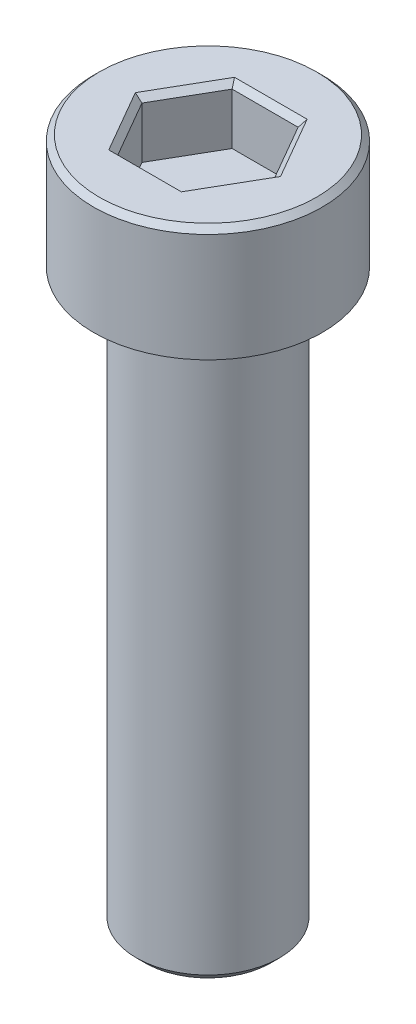
ISO-10303-21;
HEADER;
FILE_DESCRIPTION(('STEP AP214'),'2;1');
FILE_NAME('part.step','',(''),(''),'','','');
FILE_SCHEMA(('AUTOMOTIVE_DESIGN { 1 0 10303 214 1 1 1 1 }'));
ENDSEC;
DATA;
#1=APPLICATION_CONTEXT('core data for automotive mechanical design processes');
#2=APPLICATION_PROTOCOL_DEFINITION('international standard','automotive_design',2000,#1);
#3=PRODUCT_CONTEXT('',#1,'mechanical');
#4=PRODUCT('Part','Part','',(#3));
#5=PRODUCT_RELATED_PRODUCT_CATEGORY('part','',(#4));
#6=PRODUCT_DEFINITION_FORMATION('','',#4);
#7=PRODUCT_DEFINITION_CONTEXT('part definition',#1,'design');
#8=PRODUCT_DEFINITION('design','',#6,#7);
#9=PRODUCT_DEFINITION_SHAPE('','',#8);
#10=(LENGTH_UNIT() NAMED_UNIT(*) SI_UNIT(.MILLI.,.METRE.));
#11=(NAMED_UNIT(*) PLANE_ANGLE_UNIT() SI_UNIT($,.RADIAN.));
#12=(NAMED_UNIT(*) SI_UNIT($,.STERADIAN.) SOLID_ANGLE_UNIT());
#13=UNCERTAINTY_MEASURE_WITH_UNIT(LENGTH_MEASURE(1.E-05),#10,'distance_accuracy_value','');
#14=(GEOMETRIC_REPRESENTATION_CONTEXT(3) GLOBAL_UNCERTAINTY_ASSIGNED_CONTEXT((#13)) GLOBAL_UNIT_ASSIGNED_CONTEXT((#10,
#11,#12)) REPRESENTATION_CONTEXT('',''));
#15=CARTESIAN_POINT('',(0.,0.,0.));
#16=DIRECTION('',(0.,0.,1.));
#17=DIRECTION('',(1.,0.,0.));
#18=AXIS2_PLACEMENT_3D('',#15,#16,#17);
#19=CARTESIAN_POINT('',(0.,4.,0.));
#20=DIRECTION('',(0.,-1.,0.));
#21=DIRECTION('',(0.,0.,-1.));
#22=AXIS2_PLACEMENT_3D('',#19,#20,#21);
#23=CYLINDRICAL_SURFACE('',#22,4.);
#24=CARTESIAN_POINT('',(0.,3.8,0.));
#25=DIRECTION('',(0.,1.,0.));
#26=DIRECTION('',(0.,0.,1.));
#27=AXIS2_PLACEMENT_3D('',#24,#25,#26);
#28=CIRCLE('',#27,4.);
#29=CARTESIAN_POINT('',(0.,3.8,4.));
#30=VERTEX_POINT('',#29);
#31=EDGE_CURVE('E179',#30,#30,#28,.F.);
#32=ORIENTED_EDGE('',*,*,#31,.T.);
#33=EDGE_LOOP('',(#32));
#34=FACE_BOUND('',#33,.T.);
#35=CARTESIAN_POINT('',(0.,0.,0.));
#36=DIRECTION('',(0.,1.,0.));
#37=DIRECTION('',(0.,0.,1.));
#38=AXIS2_PLACEMENT_3D('',#35,#36,#37);
#39=CIRCLE('',#38,4.);
#40=CARTESIAN_POINT('',(0.,0.,4.));
#41=VERTEX_POINT('',#40);
#42=EDGE_CURVE('E149',#41,#41,#39,.T.);
#43=ORIENTED_EDGE('',*,*,#42,.T.);
#44=EDGE_LOOP('',(#43));
#45=FACE_BOUND('',#44,.T.);
#46=ADVANCED_FACE('F36',(#34,#45),#23,.T.);
#47=CARTESIAN_POINT('',(0.,4.,0.));
#48=DIRECTION('',(0.,1.,0.));
#49=DIRECTION('',(0.,0.,1.));
#50=AXIS2_PLACEMENT_3D('',#47,#48,#49);
#51=PLANE('',#50);
#52=CARTESIAN_POINT('',(0.,4.,0.));
#53=DIRECTION('',(0.,1.,0.));
#54=DIRECTION('',(0.,0.,1.));
#55=AXIS2_PLACEMENT_3D('',#52,#53,#54);
#56=CIRCLE('',#55,3.8);
#57=CARTESIAN_POINT('',(0.,4.,3.8));
#58=VERTEX_POINT('',#57);
#59=EDGE_CURVE('E176',#58,#58,#56,.T.);
#60=ORIENTED_EDGE('',*,*,#59,.T.);
#61=EDGE_LOOP('',(#60));
#62=FACE_BOUND('',#61,.T.);
#63=DIRECTION('',(0.500109828527989,0.,-0.865961984967992));
#64=VECTOR('',#63,1.);
#65=CARTESIAN_POINT('',(-1.32763927867956,4.,-2.10016839302008));
#66=LINE('',#65,#64);
#67=CARTESIAN_POINT('',(-2.54034116400461,4.,-0.000322175477218783));
#68=VERTEX_POINT('',#67);
#69=CARTESIAN_POINT('',(-1.26989156985456,4.,-2.20016107004594));
#70=VERTEX_POINT('',#69);
#71=EDGE_CURVE('E171',#68,#70,#66,.T.);
#72=ORIENTED_EDGE('',*,*,#71,.T.);
#73=DIRECTION('',(0.999999991957874,0.,0.00012682370352176));
#74=VECTOR('',#73,1.);
#75=CARTESIAN_POINT('',(1.15497954124075,4.,-2.19985353890859));
#76=LINE('',#75,#74);
#77=CARTESIAN_POINT('',(1.27044959415006,4.,-2.19983889456872));
#78=VERTEX_POINT('',#77);
#79=EDGE_CURVE('E173',#70,#78,#76,.T.);
#80=ORIENTED_EDGE('',*,*,#79,.T.);
#81=DIRECTION('',(0.499890163429886,0.,0.866088808671514));
#82=VECTOR('',#81,1.);
#83=CARTESIAN_POINT('',(2.48261881992032,4.,-0.0996851458885086));
#84=LINE('',#83,#82);
#85=CARTESIAN_POINT('',(2.54034116400462,4.,0.000322175477217576));
#86=VERTEX_POINT('',#85);
#87=EDGE_CURVE('E163',#78,#86,#84,.T.);
#88=ORIENTED_EDGE('',*,*,#87,.T.);
#89=DIRECTION('',(-0.500109828527989,0.,0.865961984967992));
#90=VECTOR('',#89,1.);
#91=CARTESIAN_POINT('',(1.32763927867956,4.,2.10016839302008));
#92=LINE('',#91,#90);
#93=CARTESIAN_POINT('',(1.26989156985456,4.,2.20016107004594));
#94=VERTEX_POINT('',#93);
#95=EDGE_CURVE('E165',#86,#94,#92,.T.);
#96=ORIENTED_EDGE('',*,*,#95,.T.);
#97=DIRECTION('',(-0.999999991957874,0.,-0.000126823703521948));
#98=VECTOR('',#97,1.);
#99=CARTESIAN_POINT('',(-1.15497954124075,4.,2.19985353890859));
#100=LINE('',#99,#98);
#101=CARTESIAN_POINT('',(-1.27044959415006,4.,2.19983889456872));
#102=VERTEX_POINT('',#101);
#103=EDGE_CURVE('E167',#94,#102,#100,.T.);
#104=ORIENTED_EDGE('',*,*,#103,.T.);
#105=DIRECTION('',(-0.499890163429885,0.,-0.866088808671514));
#106=VECTOR('',#105,1.);
#107=CARTESIAN_POINT('',(-2.48261881992032,4.,0.0996851458885071));
#108=LINE('',#107,#106);
#109=EDGE_CURVE('E169',#102,#68,#108,.T.);
#110=ORIENTED_EDGE('',*,*,#109,.T.);
#111=EDGE_LOOP('',(#72,#80,#88,#96,#104,#110));
#112=FACE_BOUND('',#111,.T.);
#113=ADVANCED_FACE('F218',(#62,#112),#51,.T.);
#114=CARTESIAN_POINT('',(0.,0.,0.));
#115=DIRECTION('',(0.,1.,0.));
#116=DIRECTION('',(0.,0.,1.));
#117=AXIS2_PLACEMENT_3D('',#114,#115,#116);
#118=PLANE('',#117);
#119=CARTESIAN_POINT('',(0.,0.,0.));
#120=DIRECTION('',(0.,1.,0.));
#121=DIRECTION('',(0.,0.,1.));
#122=AXIS2_PLACEMENT_3D('',#119,#120,#121);
#123=CIRCLE('',#122,2.5);
#124=CARTESIAN_POINT('',(0.,0.,2.5));
#125=VERTEX_POINT('',#124);
#126=EDGE_CURVE('E160',#125,#125,#123,.F.);
#127=ORIENTED_EDGE('',*,*,#126,.F.);
#128=EDGE_LOOP('',(#127));
#129=FACE_BOUND('',#128,.T.);
#130=ORIENTED_EDGE('',*,*,#42,.F.);
#131=EDGE_LOOP('',(#130));
#132=FACE_BOUND('',#131,.T.);
#133=ADVANCED_FACE('F224',(#129,#132),#118,.F.);
#134=CARTESIAN_POINT('',(0.,-20.,0.));
#135=DIRECTION('',(0.,1.,0.));
#136=DIRECTION('',(0.,0.,1.));
#137=AXIS2_PLACEMENT_3D('',#134,#135,#136);
#138=CYLINDRICAL_SURFACE('',#137,2.5);
#139=CARTESIAN_POINT('',(0.,-19.7,0.));
#140=DIRECTION('',(0.,-1.,0.));
#141=DIRECTION('',(0.,0.,-1.));
#142=AXIS2_PLACEMENT_3D('',#139,#140,#141);
#143=CIRCLE('',#142,2.5);
#144=CARTESIAN_POINT('',(0.,-19.7,-2.5));
#145=VERTEX_POINT('',#144);
#146=EDGE_CURVE('E11',#145,#145,#143,.F.);
#147=ORIENTED_EDGE('',*,*,#146,.T.);
#148=EDGE_LOOP('',(#147));
#149=FACE_BOUND('',#148,.T.);
#150=ORIENTED_EDGE('',*,*,#126,.T.);
#151=EDGE_LOOP('',(#150));
#152=FACE_BOUND('',#151,.T.);
#153=ADVANCED_FACE('F294',(#149,#152),#138,.T.);
#154=CARTESIAN_POINT('',(0.,-20.,0.));
#155=DIRECTION('',(0.,-1.,0.));
#156=DIRECTION('',(0.,0.,-1.));
#157=AXIS2_PLACEMENT_3D('',#154,#155,#156);
#158=PLANE('',#157);
#159=CARTESIAN_POINT('',(0.,-20.,0.));
#160=DIRECTION('',(0.,-1.,0.));
#161=DIRECTION('',(0.,0.,-1.));
#162=AXIS2_PLACEMENT_3D('',#159,#160,#161);
#163=CIRCLE('',#162,2.2);
#164=CARTESIAN_POINT('',(0.,-20.,-2.2));
#165=VERTEX_POINT('',#164);
#166=EDGE_CURVE('E44',#165,#165,#163,.T.);
#167=ORIENTED_EDGE('',*,*,#166,.T.);
#168=EDGE_LOOP('',(#167));
#169=FACE_BOUND('',#168,.T.);
#170=ADVANCED_FACE('F205',(#169),#158,.T.);
#171=CARTESIAN_POINT('',(2.30940105818601,2.,0.000292886797471428));
#172=DIRECTION('',(0.866088808671514,0.,-0.499890163429886));
#173=DIRECTION('',(-0.499890163429886,0.,-0.866088808671514));
#174=AXIS2_PLACEMENT_3D('',#171,#172,#173);
#175=PLANE('',#174);
#176=DIRECTION('',(0.,1.,0.));
#177=VECTOR('',#176,1.);
#178=CARTESIAN_POINT('',(2.30940105818601,2.,0.000292886797471428));
#179=LINE('',#178,#177);
#180=CARTESIAN_POINT('',(2.30940105818601,2.,0.000292886797471428));
#181=VERTEX_POINT('',#180);
#182=CARTESIAN_POINT('',(2.30940105818601,3.8,0.000292886797471428));
#183=VERTEX_POINT('',#182);
#184=EDGE_CURVE('E147',#181,#183,#179,.T.);
#185=ORIENTED_EDGE('',*,*,#184,.T.);
#186=DIRECTION('',(-0.499890163429886,0.,-0.866088808671514));
#187=VECTOR('',#186,1.);
#188=CARTESIAN_POINT('',(1.15495417650005,3.8,-1.99985354051701));
#189=LINE('',#188,#187);
#190=CARTESIAN_POINT('',(1.15495417650005,3.8,-1.99985354051701));
#191=VERTEX_POINT('',#190);
#192=EDGE_CURVE('E115',#183,#191,#189,.T.);
#193=ORIENTED_EDGE('',*,*,#192,.T.);
#194=DIRECTION('',(0.,1.,0.));
#195=VECTOR('',#194,1.);
#196=CARTESIAN_POINT('',(1.15495417650005,2.,-1.99985354051701));
#197=LINE('',#196,#195);
#198=CARTESIAN_POINT('',(1.15495417650005,2.,-1.99985354051701));
#199=VERTEX_POINT('',#198);
#200=EDGE_CURVE('E108',#199,#191,#197,.T.);
#201=ORIENTED_EDGE('',*,*,#200,.F.);
#202=DIRECTION('',(-0.499890163429885,0.,-0.866088808671514));
#203=VECTOR('',#202,1.);
#204=CARTESIAN_POINT('',(2.30940105818601,2.,0.000292886797471428));
#205=LINE('',#204,#203);
#206=EDGE_CURVE('E112',#181,#199,#205,.T.);
#207=ORIENTED_EDGE('',*,*,#206,.F.);
#208=EDGE_LOOP('',(#185,#193,#201,#207));
#209=FACE_BOUND('',#208,.T.);
#210=ADVANCED_FACE('F110',(#209),#175,.F.);
#211=CARTESIAN_POINT('',(1.15444688168596,2.,2.00014642731448));
#212=DIRECTION('',(0.865961984967992,0.,0.500109828527989));
#213=DIRECTION('',(0.500109828527989,0.,-0.865961984967992));
#214=AXIS2_PLACEMENT_3D('',#211,#212,#213);
#215=PLANE('',#214);
#216=DIRECTION('',(0.,1.,0.));
#217=VECTOR('',#216,1.);
#218=CARTESIAN_POINT('',(1.15444688168596,2.,2.00014642731448));
#219=LINE('',#218,#217);
#220=CARTESIAN_POINT('',(1.15444688168596,2.,2.00014642731448));
#221=VERTEX_POINT('',#220);
#222=CARTESIAN_POINT('',(1.15444688168596,3.8,2.00014642731448));
#223=VERTEX_POINT('',#222);
#224=EDGE_CURVE('E150',#221,#223,#219,.T.);
#225=ORIENTED_EDGE('',*,*,#224,.T.);
#226=DIRECTION('',(0.500109828527989,0.,-0.865961984967992));
#227=VECTOR('',#226,1.);
#228=CARTESIAN_POINT('',(2.30940105818601,3.8,0.000292886797471356));
#229=LINE('',#228,#227);
#230=EDGE_CURVE('E51',#223,#183,#229,.T.);
#231=ORIENTED_EDGE('',*,*,#230,.T.);
#232=ORIENTED_EDGE('',*,*,#184,.F.);
#233=DIRECTION('',(0.500109828527989,0.,-0.865961984967992));
#234=VECTOR('',#233,1.);
#235=CARTESIAN_POINT('',(1.15444688168596,2.,2.00014642731448));
#236=LINE('',#235,#234);
#237=EDGE_CURVE('E120',#221,#181,#236,.T.);
#238=ORIENTED_EDGE('',*,*,#237,.F.);
#239=EDGE_LOOP('',(#225,#231,#232,#238));
#240=FACE_BOUND('',#239,.T.);
#241=ADVANCED_FACE('F275',(#240),#215,.F.);
#242=CARTESIAN_POINT('',(-1.15495417650005,2.,1.99985354051701));
#243=DIRECTION('',(-0.000126823703521948,0.,0.999999991957874));
#244=DIRECTION('',(0.999999991957874,0.,0.000126823703521948));
#245=AXIS2_PLACEMENT_3D('',#242,#243,#244);
#246=PLANE('',#245);
#247=DIRECTION('',(0.,1.,0.));
#248=VECTOR('',#247,1.);
#249=CARTESIAN_POINT('',(-1.15495417650005,2.,1.99985354051701));
#250=LINE('',#249,#248);
#251=CARTESIAN_POINT('',(-1.15495417650005,2.,1.99985354051701));
#252=VERTEX_POINT('',#251);
#253=CARTESIAN_POINT('',(-1.15495417650005,3.8,1.99985354051701));
#254=VERTEX_POINT('',#253);
#255=EDGE_CURVE('E152',#252,#254,#250,.T.);
#256=ORIENTED_EDGE('',*,*,#255,.T.);
#257=DIRECTION('',(0.999999991957874,0.,0.000126823703521948));
#258=VECTOR('',#257,1.);
#259=CARTESIAN_POINT('',(1.15444688168596,3.8,2.00014642731448));
#260=LINE('',#259,#258);
#261=EDGE_CURVE('E59',#254,#223,#260,.T.);
#262=ORIENTED_EDGE('',*,*,#261,.T.);
#263=ORIENTED_EDGE('',*,*,#224,.F.);
#264=DIRECTION('',(0.999999991957874,0.,0.000126823703521948));
#265=VECTOR('',#264,1.);
#266=CARTESIAN_POINT('',(-1.15495417650005,2.,1.99985354051701));
#267=LINE('',#266,#265);
#268=EDGE_CURVE('E144',#252,#221,#267,.T.);
#269=ORIENTED_EDGE('',*,*,#268,.F.);
#270=EDGE_LOOP('',(#256,#262,#263,#269));
#271=FACE_BOUND('',#270,.T.);
#272=ADVANCED_FACE('F274',(#271),#246,.F.);
#273=CARTESIAN_POINT('',(-2.30940105818601,2.,-0.00029288679747257));
#274=DIRECTION('',(-0.866088808671514,0.,0.499890163429885));
#275=DIRECTION('',(0.499890163429885,0.,0.866088808671514));
#276=AXIS2_PLACEMENT_3D('',#273,#274,#275);
#277=PLANE('',#276);
#278=DIRECTION('',(0.,1.,0.));
#279=VECTOR('',#278,1.);
#280=CARTESIAN_POINT('',(-2.30940105818601,2.,-0.00029288679747257));
#281=LINE('',#280,#279);
#282=CARTESIAN_POINT('',(-2.30940105818601,2.,-0.00029288679747257));
#283=VERTEX_POINT('',#282);
#284=CARTESIAN_POINT('',(-2.30940105818601,3.8,-0.00029288679747257));
#285=VERTEX_POINT('',#284);
#286=EDGE_CURVE('E154',#283,#285,#281,.T.);
#287=ORIENTED_EDGE('',*,*,#286,.T.);
#288=DIRECTION('',(0.499890163429885,0.,0.866088808671514));
#289=VECTOR('',#288,1.);
#290=CARTESIAN_POINT('',(-1.15495417650005,3.8,1.99985354051701));
#291=LINE('',#290,#289);
#292=EDGE_CURVE('E186',#285,#254,#291,.T.);
#293=ORIENTED_EDGE('',*,*,#292,.T.);
#294=ORIENTED_EDGE('',*,*,#255,.F.);
#295=DIRECTION('',(0.499890163429885,0.,0.866088808671514));
#296=VECTOR('',#295,1.);
#297=CARTESIAN_POINT('',(-2.30940105818601,2.,-0.00029288679747257));
#298=LINE('',#297,#296);
#299=EDGE_CURVE('E141',#283,#252,#298,.T.);
#300=ORIENTED_EDGE('',*,*,#299,.F.);
#301=EDGE_LOOP('',(#287,#293,#294,#300));
#302=FACE_BOUND('',#301,.T.);
#303=ADVANCED_FACE('F273',(#302),#277,.F.);
#304=CARTESIAN_POINT('',(-1.15444688168596,2.,-2.00014642731448));
#305=DIRECTION('',(-0.865961984967992,0.,-0.500109828527989));
#306=DIRECTION('',(-0.500109828527989,0.,0.865961984967992));
#307=AXIS2_PLACEMENT_3D('',#304,#305,#306);
#308=PLANE('',#307);
#309=DIRECTION('',(0.,1.,0.));
#310=VECTOR('',#309,1.);
#311=CARTESIAN_POINT('',(-1.15444688168596,2.,-2.00014642731448));
#312=LINE('',#311,#310);
#313=CARTESIAN_POINT('',(-1.15444688168596,2.,-2.00014642731448));
#314=VERTEX_POINT('',#313);
#315=CARTESIAN_POINT('',(-1.15444688168596,3.8,-2.00014642731448));
#316=VERTEX_POINT('',#315);
#317=EDGE_CURVE('E119',#314,#316,#312,.T.);
#318=ORIENTED_EDGE('',*,*,#317,.T.);
#319=DIRECTION('',(-0.500109828527989,0.,0.865961984967992));
#320=VECTOR('',#319,1.);
#321=CARTESIAN_POINT('',(-2.30940105818601,3.8,-0.000292886797472509));
#322=LINE('',#321,#320);
#323=EDGE_CURVE('E184',#316,#285,#322,.T.);
#324=ORIENTED_EDGE('',*,*,#323,.T.);
#325=ORIENTED_EDGE('',*,*,#286,.F.);
#326=DIRECTION('',(-0.500109828527989,0.,0.865961984967992));
#327=VECTOR('',#326,1.);
#328=CARTESIAN_POINT('',(-1.15444688168596,2.,-2.00014642731448));
#329=LINE('',#328,#327);
#330=EDGE_CURVE('E129',#314,#283,#329,.T.);
#331=ORIENTED_EDGE('',*,*,#330,.F.);
#332=EDGE_LOOP('',(#318,#324,#325,#331));
#333=FACE_BOUND('',#332,.T.);
#334=ADVANCED_FACE('F269',(#333),#308,.F.);
#335=CARTESIAN_POINT('',(1.15495417650005,2.,-1.99985354051701));
#336=DIRECTION('',(0.00012682370352176,0.,-0.999999991957874));
#337=DIRECTION('',(-0.999999991957874,0.,-0.00012682370352176));
#338=AXIS2_PLACEMENT_3D('',#335,#336,#337);
#339=PLANE('',#338);
#340=ORIENTED_EDGE('',*,*,#200,.T.);
#341=DIRECTION('',(-0.999999991957874,0.,-0.00012682370352176));
#342=VECTOR('',#341,1.);
#343=CARTESIAN_POINT('',(-1.15444688168596,3.8,-2.00014642731448));
#344=LINE('',#343,#342);
#345=EDGE_CURVE('E182',#191,#316,#344,.T.);
#346=ORIENTED_EDGE('',*,*,#345,.T.);
#347=ORIENTED_EDGE('',*,*,#317,.F.);
#348=DIRECTION('',(-0.999999991957874,0.,-0.00012682370352176));
#349=VECTOR('',#348,1.);
#350=CARTESIAN_POINT('',(1.15495417650005,2.,-1.99985354051701));
#351=LINE('',#350,#349);
#352=EDGE_CURVE('E123',#199,#314,#351,.T.);
#353=ORIENTED_EDGE('',*,*,#352,.F.);
#354=EDGE_LOOP('',(#340,#346,#347,#353));
#355=FACE_BOUND('',#354,.T.);
#356=ADVANCED_FACE('F124',(#355),#339,.F.);
#357=CARTESIAN_POINT('',(0.,2.,0.));
#358=DIRECTION('',(0.,1.,0.));
#359=DIRECTION('',(0.,0.,1.));
#360=AXIS2_PLACEMENT_3D('',#357,#358,#359);
#361=PLANE('',#360);
#362=ORIENTED_EDGE('',*,*,#206,.T.);
#363=ORIENTED_EDGE('',*,*,#352,.T.);
#364=ORIENTED_EDGE('',*,*,#330,.T.);
#365=ORIENTED_EDGE('',*,*,#299,.T.);
#366=ORIENTED_EDGE('',*,*,#268,.T.);
#367=ORIENTED_EDGE('',*,*,#237,.T.);
#368=EDGE_LOOP('',(#362,#363,#364,#365,#366,#367));
#369=FACE_BOUND('',#368,.T.);
#370=ADVANCED_FACE('F131',(#369),#361,.T.);
#371=CARTESIAN_POINT('',(0.,4.,0.));
#372=DIRECTION('',(0.,-1.,0.));
#373=DIRECTION('',(0.,0.,-1.));
#374=AXIS2_PLACEMENT_3D('',#371,#372,#373);
#375=CONICAL_SURFACE('',#374,3.8,0.785398163397448);
#376=ORIENTED_EDGE('',*,*,#31,.F.);
#377=EDGE_LOOP('',(#376));
#378=FACE_BOUND('',#377,.T.);
#379=ORIENTED_EDGE('',*,*,#59,.F.);
#380=EDGE_LOOP('',(#379));
#381=FACE_BOUND('',#380,.T.);
#382=ADVANCED_FACE('F230',(#378,#381),#375,.T.);
#383=CARTESIAN_POINT('',(-1.15495417650005,3.8,1.99985354051701));
#384=DIRECTION('',(8.9677900775561E-05,0.707106781186552,-0.707106775499901));
#385=DIRECTION('',(-0.999999991957874,0.,-0.000126823703521948));
#386=AXIS2_PLACEMENT_3D('',#383,#384,#385);
#387=PLANE('',#386);
#388=DIRECTION('',(-0.378047495572637,0.654653670707972,0.654605730588906));
#389=VECTOR('',#388,1.);
#390=CARTESIAN_POINT('',(-0.824967268928601,3.22857142857143,1.428466814655));
#391=LINE('',#390,#389);
#392=EDGE_CURVE('E137',#102,#254,#391,.F.);
#393=ORIENTED_EDGE('',*,*,#392,.F.);
#394=ORIENTED_EDGE('',*,*,#103,.F.);
#395=DIRECTION('',(0.377881444366548,0.654653670707972,0.654701600297441));
#396=VECTOR('',#395,1.);
#397=CARTESIAN_POINT('',(0.824604915489968,3.22857142857143,1.42867601951034));
#398=LINE('',#397,#396);
#399=EDGE_CURVE('E134',#223,#94,#398,.T.);
#400=ORIENTED_EDGE('',*,*,#399,.F.);
#401=ORIENTED_EDGE('',*,*,#261,.F.);
#402=EDGE_LOOP('',(#393,#394,#400,#401));
#403=FACE_BOUND('',#402,.T.);
#404=ADVANCED_FACE('F232',(#403),#387,.T.);
#405=CARTESIAN_POINT('',(1.15444688168596,3.8,2.00014642731448));
#406=DIRECTION('',(-0.612327591820627,0.707106781186552,-0.35363105109018));
#407=DIRECTION('',(-0.500109828527989,0.,0.865961984967992));
#408=AXIS2_PLACEMENT_3D('',#405,#406,#407);
#409=PLANE('',#408);
#410=ORIENTED_EDGE('',*,*,#399,.T.);
#411=ORIENTED_EDGE('',*,*,#95,.F.);
#412=DIRECTION('',(0.755928939939184,0.654653670707971,9.58697085294401E-05));
#413=VECTOR('',#412,1.);
#414=CARTESIAN_POINT('',(1.64957218441856,3.22857142857142,0.000209204855339869));
#415=LINE('',#414,#413);
#416=EDGE_CURVE('E198',#183,#86,#415,.T.);
#417=ORIENTED_EDGE('',*,*,#416,.F.);
#418=ORIENTED_EDGE('',*,*,#230,.F.);
#419=EDGE_LOOP('',(#410,#411,#417,#418));
#420=FACE_BOUND('',#419,.T.);
#421=ADVANCED_FACE('F245',(#420),#409,.T.);
#422=CARTESIAN_POINT('',(-2.30940105818601,3.8,-0.00029288679747257));
#423=DIRECTION('',(0.612417269721401,0.707106781186553,-0.35347572440972));
#424=DIRECTION('',(-0.499890163429885,0.,-0.866088808671514));
#425=AXIS2_PLACEMENT_3D('',#422,#423,#424);
#426=PLANE('',#425);
#427=ORIENTED_EDGE('',*,*,#392,.T.);
#428=ORIENTED_EDGE('',*,*,#292,.F.);
#429=DIRECTION('',(-0.755928939939183,0.654653670707972,-9.58697085308663E-05));
#430=VECTOR('',#429,1.);
#431=CARTESIAN_POINT('',(-1.64957218441857,3.22857142857142,-0.000209204855339869));
#432=LINE('',#431,#430);
#433=EDGE_CURVE('E195',#68,#285,#432,.F.);
#434=ORIENTED_EDGE('',*,*,#433,.F.);
#435=ORIENTED_EDGE('',*,*,#109,.F.);
#436=EDGE_LOOP('',(#427,#428,#434,#435));
#437=FACE_BOUND('',#436,.T.);
#438=ADVANCED_FACE('F241',(#437),#426,.T.);
#439=CARTESIAN_POINT('',(2.30940105818601,3.8,0.000292886797471428));
#440=DIRECTION('',(-0.6124172697214,0.707106781186554,0.35347572440972));
#441=DIRECTION('',(0.499890163429886,0.,0.866088808671514));
#442=AXIS2_PLACEMENT_3D('',#439,#440,#441);
#443=PLANE('',#442);
#444=ORIENTED_EDGE('',*,*,#416,.T.);
#445=ORIENTED_EDGE('',*,*,#87,.F.);
#446=DIRECTION('',(-0.378047495572636,-0.654653670707971,0.654605730588907));
#447=VECTOR('',#446,1.);
#448=CARTESIAN_POINT('',(1.15495417650005,3.8,-1.99985354051701));
#449=LINE('',#448,#447);
#450=EDGE_CURVE('E193',#191,#78,#449,.F.);
#451=ORIENTED_EDGE('',*,*,#450,.F.);
#452=ORIENTED_EDGE('',*,*,#192,.F.);
#453=EDGE_LOOP('',(#444,#445,#451,#452));
#454=FACE_BOUND('',#453,.T.);
#455=ADVANCED_FACE('F237',(#454),#443,.T.);
#456=CARTESIAN_POINT('',(-1.15444688168596,3.8,-2.00014642731448));
#457=DIRECTION('',(0.612327591820627,0.707106781186552,0.35363105109018));
#458=DIRECTION('',(0.500109828527989,0.,-0.865961984967992));
#459=AXIS2_PLACEMENT_3D('',#456,#457,#458);
#460=PLANE('',#459);
#461=ORIENTED_EDGE('',*,*,#433,.T.);
#462=ORIENTED_EDGE('',*,*,#323,.F.);
#463=DIRECTION('',(-0.377881444366546,0.654653670707972,-0.654701600297442));
#464=VECTOR('',#463,1.);
#465=CARTESIAN_POINT('',(-0.824604915489973,3.22857142857143,-1.42867601951034));
#466=LINE('',#465,#464);
#467=EDGE_CURVE('E191',#70,#316,#466,.F.);
#468=ORIENTED_EDGE('',*,*,#467,.F.);
#469=ORIENTED_EDGE('',*,*,#71,.F.);
#470=EDGE_LOOP('',(#461,#462,#468,#469));
#471=FACE_BOUND('',#470,.T.);
#472=ADVANCED_FACE('F213',(#471),#460,.T.);
#473=CARTESIAN_POINT('',(1.15495417650005,3.8,-1.99985354051701));
#474=DIRECTION('',(-8.96779007754281E-05,0.707106781186553,0.7071067754999));
#475=DIRECTION('',(0.999999991957874,0.,0.00012682370352176));
#476=AXIS2_PLACEMENT_3D('',#473,#474,#475);
#477=PLANE('',#476);
#478=ORIENTED_EDGE('',*,*,#450,.T.);
#479=ORIENTED_EDGE('',*,*,#79,.F.);
#480=ORIENTED_EDGE('',*,*,#467,.T.);
#481=ORIENTED_EDGE('',*,*,#345,.F.);
#482=EDGE_LOOP('',(#478,#479,#480,#481));
#483=FACE_BOUND('',#482,.T.);
#484=ADVANCED_FACE('F208',(#483),#477,.T.);
#485=CARTESIAN_POINT('',(0.,-20.,0.));
#486=DIRECTION('',(0.,1.,0.));
#487=DIRECTION('',(0.,0.,1.));
#488=AXIS2_PLACEMENT_3D('',#485,#486,#487);
#489=CONICAL_SURFACE('',#488,2.2,0.785398163397445);
#490=ORIENTED_EDGE('',*,*,#146,.F.);
#491=EDGE_LOOP('',(#490));
#492=FACE_BOUND('',#491,.T.);
#493=ORIENTED_EDGE('',*,*,#166,.F.);
#494=EDGE_LOOP('',(#493));
#495=FACE_BOUND('',#494,.T.);
#496=ADVANCED_FACE('F38',(#492,#495),#489,.T.);
#497=CLOSED_SHELL('',(#46,#113,#133,#153,#170,#210,#241,#272,#303,#334,#356,#370,#382,#404,#421,
#438,#455,#472,#484,#496));
#498=MANIFOLD_SOLID_BREP('B2',#497);
#499=ADVANCED_BREP_SHAPE_REPRESENTATION('',(#18,#498),#14);
#500=SHAPE_DEFINITION_REPRESENTATION(#9,#499);
ENDSEC;
END-ISO-10303-21;
